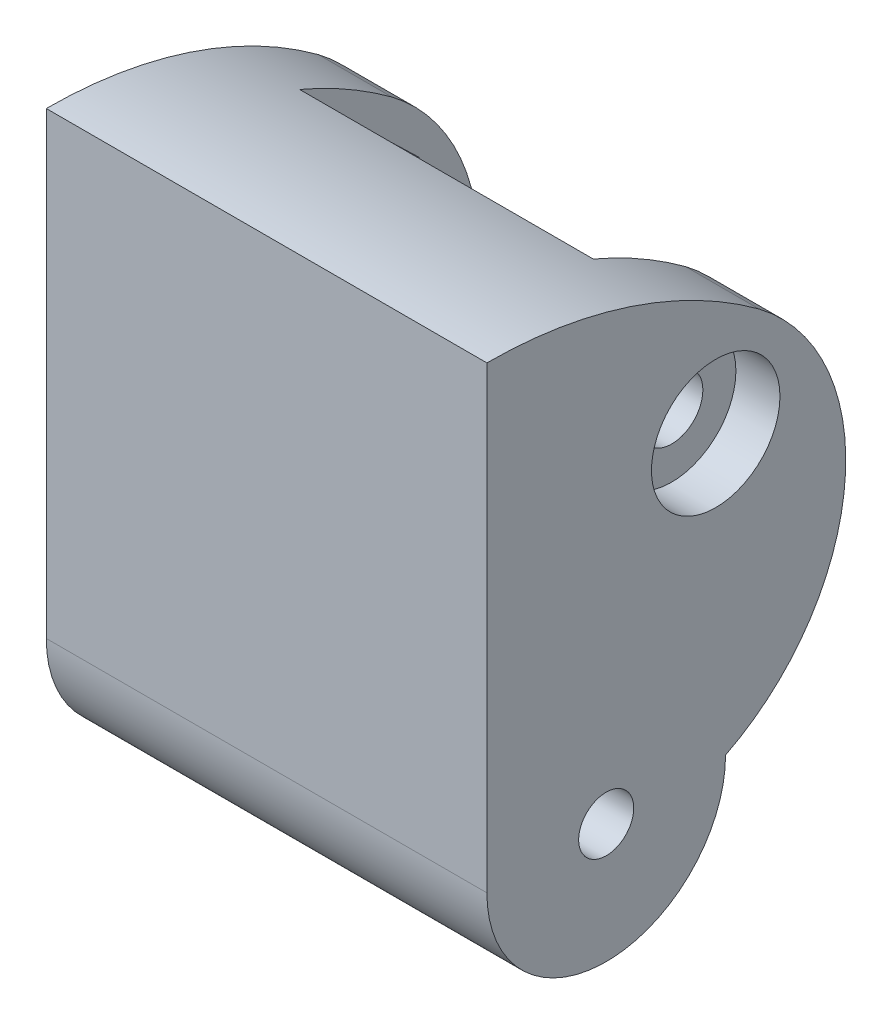
ISO-10303-21;
HEADER;
FILE_DESCRIPTION(('STEP AP214'),'2;1');
FILE_NAME('part.step','',(''),(''),'','','');
FILE_SCHEMA(('AUTOMOTIVE_DESIGN { 1 0 10303 214 1 1 1 1 }'));
ENDSEC;
DATA;
#1=APPLICATION_CONTEXT('core data for automotive mechanical design processes');
#2=APPLICATION_PROTOCOL_DEFINITION('international standard','automotive_design',2000,#1);
#3=PRODUCT_CONTEXT('',#1,'mechanical');
#4=PRODUCT('Part','Part','',(#3));
#5=PRODUCT_RELATED_PRODUCT_CATEGORY('part','',(#4));
#6=PRODUCT_DEFINITION_FORMATION('','',#4);
#7=PRODUCT_DEFINITION_CONTEXT('part definition',#1,'design');
#8=PRODUCT_DEFINITION('design','',#6,#7);
#9=PRODUCT_DEFINITION_SHAPE('','',#8);
#10=(LENGTH_UNIT() NAMED_UNIT(*) SI_UNIT(.MILLI.,.METRE.));
#11=(NAMED_UNIT(*) PLANE_ANGLE_UNIT() SI_UNIT($,.RADIAN.));
#12=(NAMED_UNIT(*) SI_UNIT($,.STERADIAN.) SOLID_ANGLE_UNIT());
#13=UNCERTAINTY_MEASURE_WITH_UNIT(LENGTH_MEASURE(1.E-05),#10,'distance_accuracy_value','');
#14=(GEOMETRIC_REPRESENTATION_CONTEXT(3) GLOBAL_UNCERTAINTY_ASSIGNED_CONTEXT((#13)) GLOBAL_UNIT_ASSIGNED_CONTEXT((#10,
#11,#12)) REPRESENTATION_CONTEXT('',''));
#15=CARTESIAN_POINT('',(0.,0.,0.));
#16=DIRECTION('',(0.,0.,1.));
#17=DIRECTION('',(1.,0.,0.));
#18=AXIS2_PLACEMENT_3D('',#15,#16,#17);
#19=CARTESIAN_POINT('',(24.,6.90912750795795,5.26739573253868));
#20=DIRECTION('',(-1.,0.,0.));
#21=DIRECTION('',(0.,0.,1.));
#22=AXIS2_PLACEMENT_3D('',#19,#20,#21);
#23=CYLINDRICAL_SURFACE('',#22,11.9077785335107);
#24=CARTESIAN_POINT('',(20.,6.90912750795795,5.26739573253868));
#25=DIRECTION('',(-1.,0.,0.));
#26=DIRECTION('',(0.,0.,1.));
#27=AXIS2_PLACEMENT_3D('',#24,#25,#26);
#28=CIRCLE('',#27,11.9077785335107);
#29=CARTESIAN_POINT('',(20.,16.4064601891265,-1.91563019991807));
#30=VERTEX_POINT('',#29);
#31=CARTESIAN_POINT('',(20.,2.27551020408163,-5.70186952473154));
#32=VERTEX_POINT('',#31);
#33=EDGE_CURVE('E210',#30,#32,#28,.T.);
#34=ORIENTED_EDGE('',*,*,#33,.F.);
#35=DIRECTION('',(-1.,0.,0.));
#36=VECTOR('',#35,1.);
#37=CARTESIAN_POINT('',(24.,16.4064601891265,-1.91563019991807));
#38=LINE('',#37,#36);
#39=CARTESIAN_POINT('',(24.,16.4064601891265,-1.91563019991807));
#40=VERTEX_POINT('',#39);
#41=EDGE_CURVE('E254',#40,#30,#38,.T.);
#42=ORIENTED_EDGE('',*,*,#41,.F.);
#43=CARTESIAN_POINT('',(24.,6.90912750795795,5.26739573253868));
#44=DIRECTION('',(1.,0.,0.));
#45=DIRECTION('',(0.,0.,-1.));
#46=AXIS2_PLACEMENT_3D('',#43,#44,#45);
#47=CIRCLE('',#46,11.9077785335107);
#48=CARTESIAN_POINT('',(24.,-3.72448979591837,-0.0918367346938826));
#49=VERTEX_POINT('',#48);
#50=EDGE_CURVE('E229',#49,#40,#47,.T.);
#51=ORIENTED_EDGE('',*,*,#50,.F.);
#52=DIRECTION('',(-1.,0.,0.));
#53=VECTOR('',#52,1.);
#54=CARTESIAN_POINT('',(24.,-3.72448979591837,-0.0918367346938826));
#55=LINE('',#54,#53);
#56=CARTESIAN_POINT('',(0.,-3.72448979591837,-0.0918367346938826));
#57=VERTEX_POINT('',#56);
#58=EDGE_CURVE('E257',#49,#57,#55,.T.);
#59=ORIENTED_EDGE('',*,*,#58,.T.);
#60=CARTESIAN_POINT('',(0.,6.90912750795795,5.26739573253868));
#61=DIRECTION('',(1.,0.,0.));
#62=DIRECTION('',(0.,0.,-1.));
#63=AXIS2_PLACEMENT_3D('',#60,#61,#62);
#64=CIRCLE('',#63,11.9077785335107);
#65=CARTESIAN_POINT('',(0.,16.4064601891265,-1.91563019991807));
#66=VERTEX_POINT('',#65);
#67=EDGE_CURVE('E242',#57,#66,#64,.T.);
#68=ORIENTED_EDGE('',*,*,#67,.T.);
#69=CARTESIAN_POINT('',(4.,16.4064601891265,-1.91563019991807));
#70=VERTEX_POINT('',#69);
#71=EDGE_CURVE('E253',#70,#66,#38,.T.);
#72=ORIENTED_EDGE('',*,*,#71,.F.);
#73=CARTESIAN_POINT('',(4.,6.90912750795795,5.26739573253868));
#74=DIRECTION('',(1.,0.,0.));
#75=DIRECTION('',(0.,1.,0.));
#76=AXIS2_PLACEMENT_3D('',#73,#74,#75);
#77=CIRCLE('',#76,11.9077785335107);
#78=CARTESIAN_POINT('',(4.,2.27551020408163,-5.70186952473154));
#79=VERTEX_POINT('',#78);
#80=EDGE_CURVE('E204',#79,#70,#77,.T.);
#81=ORIENTED_EDGE('',*,*,#80,.F.);
#82=DIRECTION('',(-1.,0.,0.));
#83=VECTOR('',#82,1.);
#84=CARTESIAN_POINT('',(24.,2.27551020408163,-5.70186952473154));
#85=LINE('',#84,#83);
#86=EDGE_CURVE('E265',#32,#79,#85,.T.);
#87=ORIENTED_EDGE('',*,*,#86,.F.);
#88=EDGE_LOOP('',(#34,#42,#51,#59,#68,#72,#81,#87));
#89=FACE_BOUND('',#88,.T.);
#90=ADVANCED_FACE('F35',(#89),#23,.T.);
#91=CARTESIAN_POINT('',(24.,-3.72448979591837,12.9081632653061));
#92=DIRECTION('',(-1.,0.,0.));
#93=DIRECTION('',(0.,0.,1.));
#94=AXIS2_PLACEMENT_3D('',#91,#92,#93);
#95=CYLINDRICAL_SURFACE('',#94,25.);
#96=ORIENTED_EDGE('',*,*,#41,.T.);
#97=CARTESIAN_POINT('',(20.,-3.72448979591837,12.9081632653061));
#98=DIRECTION('',(-1.,0.,0.));
#99=DIRECTION('',(0.,0.,1.));
#100=AXIS2_PLACEMENT_3D('',#97,#98,#99);
#101=CIRCLE('',#100,25.);
#102=CARTESIAN_POINT('',(20.,19.2755102040816,3.1102042941734));
#103=VERTEX_POINT('',#102);
#104=EDGE_CURVE('E207',#30,#103,#101,.F.);
#105=ORIENTED_EDGE('',*,*,#104,.T.);
#106=DIRECTION('',(-1.,0.,0.));
#107=VECTOR('',#106,1.);
#108=CARTESIAN_POINT('',(24.,19.2755102040816,3.1102042941734));
#109=LINE('',#108,#107);
#110=CARTESIAN_POINT('',(4.,19.2755102040816,3.1102042941734));
#111=VERTEX_POINT('',#110);
#112=EDGE_CURVE('E260',#103,#111,#109,.T.);
#113=ORIENTED_EDGE('',*,*,#112,.T.);
#114=CARTESIAN_POINT('',(4.,-3.72448979591837,12.9081632653061));
#115=DIRECTION('',(1.,0.,0.));
#116=DIRECTION('',(0.,1.,0.));
#117=AXIS2_PLACEMENT_3D('',#114,#115,#116);
#118=CIRCLE('',#117,25.);
#119=EDGE_CURVE('E201',#111,#70,#118,.F.);
#120=ORIENTED_EDGE('',*,*,#119,.T.);
#121=ORIENTED_EDGE('',*,*,#71,.T.);
#122=CARTESIAN_POINT('',(0.,-3.72448979591837,12.9081632653061));
#123=DIRECTION('',(1.,0.,0.));
#124=DIRECTION('',(0.,0.,-1.));
#125=AXIS2_PLACEMENT_3D('',#122,#123,#124);
#126=CIRCLE('',#125,25.);
#127=CARTESIAN_POINT('',(0.,21.2755102040816,12.9081632653061));
#128=VERTEX_POINT('',#127);
#129=EDGE_CURVE('E245',#128,#66,#126,.F.);
#130=ORIENTED_EDGE('',*,*,#129,.F.);
#131=DIRECTION('',(-1.,0.,0.));
#132=VECTOR('',#131,1.);
#133=CARTESIAN_POINT('',(24.,21.2755102040816,12.9081632653061));
#134=LINE('',#133,#132);
#135=CARTESIAN_POINT('',(24.,21.2755102040816,12.9081632653061));
#136=VERTEX_POINT('',#135);
#137=EDGE_CURVE('E251',#136,#128,#134,.T.);
#138=ORIENTED_EDGE('',*,*,#137,.F.);
#139=CARTESIAN_POINT('',(24.,-3.72448979591837,12.9081632653061));
#140=DIRECTION('',(1.,0.,0.));
#141=DIRECTION('',(0.,0.,-1.));
#142=AXIS2_PLACEMENT_3D('',#139,#140,#141);
#143=CIRCLE('',#142,25.);
#144=EDGE_CURVE('E231',#136,#40,#143,.F.);
#145=ORIENTED_EDGE('',*,*,#144,.T.);
#146=EDGE_LOOP('',(#96,#105,#113,#120,#121,#130,#138,#145));
#147=FACE_BOUND('',#146,.T.);
#148=ADVANCED_FACE('F299',(#147),#95,.T.);
#149=CARTESIAN_POINT('',(24.,11.7152741478892,0.443639472137658));
#150=DIRECTION('',(1.,0.,0.));
#151=DIRECTION('',(0.,0.,-1.));
#152=AXIS2_PLACEMENT_3D('',#149,#150,#151);
#153=CYLINDRICAL_SURFACE('',#152,1.7);
#154=CARTESIAN_POINT('',(21.6,11.7152741478892,0.443639472137658));
#155=DIRECTION('',(1.,0.,0.));
#156=DIRECTION('',(0.,0.,-1.));
#157=AXIS2_PLACEMENT_3D('',#154,#155,#156);
#158=CIRCLE('',#157,1.7);
#159=CARTESIAN_POINT('',(21.6,11.7152741478892,-1.25636052786234));
#160=VERTEX_POINT('',#159);
#161=EDGE_CURVE('E218',#160,#160,#158,.T.);
#162=ORIENTED_EDGE('',*,*,#161,.T.);
#163=EDGE_LOOP('',(#162));
#164=FACE_BOUND('',#163,.T.);
#165=CARTESIAN_POINT('',(20.,11.7152741478892,0.443639472137658));
#166=DIRECTION('',(-1.,0.,0.));
#167=DIRECTION('',(0.,0.,1.));
#168=AXIS2_PLACEMENT_3D('',#165,#166,#167);
#169=CIRCLE('',#168,1.7);
#170=CARTESIAN_POINT('',(20.,11.7152741478892,2.14363947213765));
#171=VERTEX_POINT('',#170);
#172=EDGE_CURVE('E206',#171,#171,#169,.F.);
#173=ORIENTED_EDGE('',*,*,#172,.F.);
#174=EDGE_LOOP('',(#173));
#175=FACE_BOUND('',#174,.T.);
#176=ADVANCED_FACE('F305',(#164,#175),#153,.F.);
#177=CARTESIAN_POINT('',(24.,-3.72448979591837,6.40816326530612));
#178=DIRECTION('',(-1.,0.,0.));
#179=DIRECTION('',(0.,0.,1.));
#180=AXIS2_PLACEMENT_3D('',#177,#178,#179);
#181=CYLINDRICAL_SURFACE('',#180,6.5);
#182=CARTESIAN_POINT('',(0.,-3.72448979591837,6.40816326530612));
#183=DIRECTION('',(1.,0.,0.));
#184=DIRECTION('',(0.,0.,-1.));
#185=AXIS2_PLACEMENT_3D('',#182,#183,#184);
#186=CIRCLE('',#185,6.5);
#187=CARTESIAN_POINT('',(0.,-3.72448979591837,12.9081632653061));
#188=VERTEX_POINT('',#187);
#189=EDGE_CURVE('E239',#188,#57,#186,.T.);
#190=ORIENTED_EDGE('',*,*,#189,.T.);
#191=ORIENTED_EDGE('',*,*,#58,.F.);
#192=CARTESIAN_POINT('',(24.,-3.72448979591837,6.40816326530612));
#193=DIRECTION('',(1.,0.,0.));
#194=DIRECTION('',(0.,0.,-1.));
#195=AXIS2_PLACEMENT_3D('',#192,#193,#194);
#196=CIRCLE('',#195,6.5);
#197=CARTESIAN_POINT('',(24.,-3.72448979591837,12.9081632653061));
#198=VERTEX_POINT('',#197);
#199=EDGE_CURVE('E225',#198,#49,#196,.T.);
#200=ORIENTED_EDGE('',*,*,#199,.F.);
#201=DIRECTION('',(-1.,0.,0.));
#202=VECTOR('',#201,1.);
#203=CARTESIAN_POINT('',(24.,-3.72448979591837,12.9081632653061));
#204=LINE('',#203,#202);
#205=EDGE_CURVE('E236',#198,#188,#204,.T.);
#206=ORIENTED_EDGE('',*,*,#205,.T.);
#207=EDGE_LOOP('',(#190,#191,#200,#206));
#208=FACE_BOUND('',#207,.T.);
#209=ADVANCED_FACE('F310',(#208),#181,.T.);
#210=CARTESIAN_POINT('',(24.,-3.72448979591837,6.40816326530612));
#211=DIRECTION('',(-1.,0.,0.));
#212=DIRECTION('',(0.,0.,1.));
#213=AXIS2_PLACEMENT_3D('',#210,#211,#212);
#214=CYLINDRICAL_SURFACE('',#213,1.5);
#215=CARTESIAN_POINT('',(24.,-3.72448979591837,6.40816326530612));
#216=DIRECTION('',(1.,0.,0.));
#217=DIRECTION('',(0.,0.,-1.));
#218=AXIS2_PLACEMENT_3D('',#215,#216,#217);
#219=CIRCLE('',#218,1.5);
#220=CARTESIAN_POINT('',(24.,-3.72448979591837,4.90816326530612));
#221=VERTEX_POINT('',#220);
#222=EDGE_CURVE('E222',#221,#221,#219,.T.);
#223=ORIENTED_EDGE('',*,*,#222,.T.);
#224=EDGE_LOOP('',(#223));
#225=FACE_BOUND('',#224,.T.);
#226=CARTESIAN_POINT('',(0.,-3.72448979591837,6.40816326530612));
#227=DIRECTION('',(1.,0.,0.));
#228=DIRECTION('',(0.,0.,-1.));
#229=AXIS2_PLACEMENT_3D('',#226,#227,#228);
#230=CIRCLE('',#229,1.5);
#231=CARTESIAN_POINT('',(0.,-3.72448979591837,4.90816326530612));
#232=VERTEX_POINT('',#231);
#233=EDGE_CURVE('E221',#232,#232,#230,.T.);
#234=ORIENTED_EDGE('',*,*,#233,.F.);
#235=EDGE_LOOP('',(#234));
#236=FACE_BOUND('',#235,.T.);
#237=ADVANCED_FACE('F37',(#225,#236),#214,.F.);
#238=CARTESIAN_POINT('',(24.,0.,12.9081632653061));
#239=DIRECTION('',(0.,0.,-1.));
#240=DIRECTION('',(-1.,0.,0.));
#241=AXIS2_PLACEMENT_3D('',#238,#239,#240);
#242=PLANE('',#241);
#243=DIRECTION('',(0.,-1.,0.));
#244=VECTOR('',#243,1.);
#245=CARTESIAN_POINT('',(0.,0.,12.9081632653061));
#246=LINE('',#245,#244);
#247=EDGE_CURVE('E226',#128,#188,#246,.T.);
#248=ORIENTED_EDGE('',*,*,#247,.T.);
#249=ORIENTED_EDGE('',*,*,#205,.F.);
#250=DIRECTION('',(0.,-1.,0.));
#251=VECTOR('',#250,1.);
#252=CARTESIAN_POINT('',(24.,0.,12.9081632653061));
#253=LINE('',#252,#251);
#254=EDGE_CURVE('E234',#136,#198,#253,.T.);
#255=ORIENTED_EDGE('',*,*,#254,.F.);
#256=ORIENTED_EDGE('',*,*,#137,.T.);
#257=EDGE_LOOP('',(#248,#249,#255,#256));
#258=FACE_BOUND('',#257,.T.);
#259=ADVANCED_FACE('F317',(#258),#242,.F.);
#260=CARTESIAN_POINT('',(24.,0.,0.));
#261=DIRECTION('',(1.,0.,0.));
#262=DIRECTION('',(0.,0.,-1.));
#263=AXIS2_PLACEMENT_3D('',#260,#261,#262);
#264=PLANE('',#263);
#265=CARTESIAN_POINT('',(24.,11.7152741478892,0.443639472137658));
#266=DIRECTION('',(1.,0.,0.));
#267=DIRECTION('',(0.,0.,-1.));
#268=AXIS2_PLACEMENT_3D('',#265,#266,#267);
#269=CIRCLE('',#268,3.5);
#270=CARTESIAN_POINT('',(24.,11.7152741478892,-3.05636052786234));
#271=VERTEX_POINT('',#270);
#272=EDGE_CURVE('E212',#271,#271,#269,.T.);
#273=ORIENTED_EDGE('',*,*,#272,.F.);
#274=EDGE_LOOP('',(#273));
#275=FACE_BOUND('',#274,.T.);
#276=ORIENTED_EDGE('',*,*,#222,.F.);
#277=EDGE_LOOP('',(#276));
#278=FACE_BOUND('',#277,.T.);
#279=ORIENTED_EDGE('',*,*,#199,.T.);
#280=ORIENTED_EDGE('',*,*,#50,.T.);
#281=ORIENTED_EDGE('',*,*,#144,.F.);
#282=ORIENTED_EDGE('',*,*,#254,.T.);
#283=EDGE_LOOP('',(#279,#280,#281,#282));
#284=FACE_BOUND('',#283,.T.);
#285=ADVANCED_FACE('F332',(#275,#278,#284),#264,.T.);
#286=CARTESIAN_POINT('',(0.,0.,0.));
#287=DIRECTION('',(1.,0.,0.));
#288=DIRECTION('',(0.,0.,-1.));
#289=AXIS2_PLACEMENT_3D('',#286,#287,#288);
#290=PLANE('',#289);
#291=DIRECTION('',(0.,0.694815164914117,0.719188352662478));
#292=VECTOR('',#291,1.);
#293=CARTESIAN_POINT('',(0.,7.83430228401462,1.4121731018139));
#294=LINE('',#293,#292);
#295=CARTESIAN_POINT('',(0.,7.83430228401462,1.4121731018139));
#296=VERTEX_POINT('',#295);
#297=CARTESIAN_POINT('',(0.,10.6135629436711,4.28892651246382));
#298=VERTEX_POINT('',#297);
#299=EDGE_CURVE('E153',#296,#298,#294,.T.);
#300=ORIENTED_EDGE('',*,*,#299,.F.);
#301=DIRECTION('',(0.,-0.275427801054529,0.961321760081538));
#302=VECTOR('',#301,1.);
#303=CARTESIAN_POINT('',(0.,8.93601348823274,-2.43311393851226));
#304=LINE('',#303,#302);
#305=CARTESIAN_POINT('',(0.,8.93601348823274,-2.43311393851226));
#306=VERTEX_POINT('',#305);
#307=EDGE_CURVE('E50',#306,#296,#304,.T.);
#308=ORIENTED_EDGE('',*,*,#307,.F.);
#309=DIRECTION('',(0.,-0.970242965968646,0.24213340741906));
#310=VECTOR('',#309,1.);
#311=CARTESIAN_POINT('',(0.,12.8169853521073,-3.4016475681885));
#312=LINE('',#311,#310);
#313=CARTESIAN_POINT('',(0.,12.8169853521073,-3.4016475681885));
#314=VERTEX_POINT('',#313);
#315=EDGE_CURVE('E169',#314,#306,#312,.T.);
#316=ORIENTED_EDGE('',*,*,#315,.F.);
#317=DIRECTION('',(0.,-0.694815164914117,-0.719188352662478));
#318=VECTOR('',#317,1.);
#319=CARTESIAN_POINT('',(0.,15.5962460117638,-0.524894157538583));
#320=LINE('',#319,#318);
#321=CARTESIAN_POINT('',(0.,15.5962460117638,-0.524894157538583));
#322=VERTEX_POINT('',#321);
#323=EDGE_CURVE('E163',#322,#314,#320,.T.);
#324=ORIENTED_EDGE('',*,*,#323,.F.);
#325=DIRECTION('',(0.,0.275427801054529,-0.961321760081538));
#326=VECTOR('',#325,1.);
#327=CARTESIAN_POINT('',(0.,14.4945348075457,3.32039288278758));
#328=LINE('',#327,#326);
#329=CARTESIAN_POINT('',(0.,14.4945348075457,3.32039288278758));
#330=VERTEX_POINT('',#329);
#331=EDGE_CURVE('E161',#330,#322,#328,.T.);
#332=ORIENTED_EDGE('',*,*,#331,.F.);
#333=DIRECTION('',(0.,0.970242965968646,-0.24213340741906));
#334=VECTOR('',#333,1.);
#335=CARTESIAN_POINT('',(0.,10.6135629436711,4.28892651246382));
#336=LINE('',#335,#334);
#337=EDGE_CURVE('E144',#298,#330,#336,.T.);
#338=ORIENTED_EDGE('',*,*,#337,.F.);
#339=EDGE_LOOP('',(#300,#308,#316,#324,#332,#338));
#340=FACE_BOUND('',#339,.T.);
#341=ORIENTED_EDGE('',*,*,#233,.T.);
#342=EDGE_LOOP('',(#341));
#343=FACE_BOUND('',#342,.T.);
#344=ORIENTED_EDGE('',*,*,#189,.F.);
#345=ORIENTED_EDGE('',*,*,#247,.F.);
#346=ORIENTED_EDGE('',*,*,#129,.T.);
#347=ORIENTED_EDGE('',*,*,#67,.F.);
#348=EDGE_LOOP('',(#344,#345,#346,#347));
#349=FACE_BOUND('',#348,.T.);
#350=ADVANCED_FACE('F157',(#340,#343,#349),#290,.F.);
#351=CARTESIAN_POINT('',(21.6,13.4152741478892,0.443639472137658));
#352=DIRECTION('',(-1.,0.,0.));
#353=DIRECTION('',(0.,0.,1.));
#354=AXIS2_PLACEMENT_3D('',#351,#352,#353);
#355=PLANE('',#354);
#356=ORIENTED_EDGE('',*,*,#161,.F.);
#357=EDGE_LOOP('',(#356));
#358=FACE_BOUND('',#357,.T.);
#359=CARTESIAN_POINT('',(21.6,11.7152741478892,0.443639472137658));
#360=DIRECTION('',(1.,0.,0.));
#361=DIRECTION('',(0.,0.,-1.));
#362=AXIS2_PLACEMENT_3D('',#359,#360,#361);
#363=CIRCLE('',#362,3.5);
#364=CARTESIAN_POINT('',(21.6,11.7152741478892,-3.05636052786234));
#365=VERTEX_POINT('',#364);
#366=EDGE_CURVE('E215',#365,#365,#363,.T.);
#367=ORIENTED_EDGE('',*,*,#366,.T.);
#368=EDGE_LOOP('',(#367));
#369=FACE_BOUND('',#368,.T.);
#370=ADVANCED_FACE('F369',(#358,#369),#355,.F.);
#371=CARTESIAN_POINT('',(24.,11.7152741478892,0.443639472137658));
#372=DIRECTION('',(1.,0.,0.));
#373=DIRECTION('',(0.,0.,-1.));
#374=AXIS2_PLACEMENT_3D('',#371,#372,#373);
#375=CYLINDRICAL_SURFACE('',#374,3.5);
#376=ORIENTED_EDGE('',*,*,#366,.F.);
#377=EDGE_LOOP('',(#376));
#378=FACE_BOUND('',#377,.T.);
#379=ORIENTED_EDGE('',*,*,#272,.T.);
#380=EDGE_LOOP('',(#379));
#381=FACE_BOUND('',#380,.T.);
#382=ADVANCED_FACE('F366',(#378,#381),#375,.F.);
#383=CARTESIAN_POINT('',(20.,2.27551020408163,9.));
#384=DIRECTION('',(0.,1.,0.));
#385=DIRECTION('',(-1.,0.,0.));
#386=AXIS2_PLACEMENT_3D('',#383,#384,#385);
#387=PLANE('',#386);
#388=ORIENTED_EDGE('',*,*,#86,.T.);
#389=DIRECTION('',(0.,0.,-1.));
#390=VECTOR('',#389,1.);
#391=CARTESIAN_POINT('',(4.,2.27551020408163,9.));
#392=LINE('',#391,#390);
#393=CARTESIAN_POINT('',(4.,2.27551020408163,9.));
#394=VERTEX_POINT('',#393);
#395=EDGE_CURVE('E192',#394,#79,#392,.T.);
#396=ORIENTED_EDGE('',*,*,#395,.F.);
#397=DIRECTION('',(1.,0.,0.));
#398=VECTOR('',#397,1.);
#399=CARTESIAN_POINT('',(20.,2.27551020408163,9.));
#400=LINE('',#399,#398);
#401=CARTESIAN_POINT('',(20.,2.27551020408163,9.));
#402=VERTEX_POINT('',#401);
#403=EDGE_CURVE('E187',#394,#402,#400,.T.);
#404=ORIENTED_EDGE('',*,*,#403,.T.);
#405=DIRECTION('',(0.,0.,-1.));
#406=VECTOR('',#405,1.);
#407=CARTESIAN_POINT('',(20.,2.27551020408163,9.));
#408=LINE('',#407,#406);
#409=EDGE_CURVE('E189',#402,#32,#408,.T.);
#410=ORIENTED_EDGE('',*,*,#409,.T.);
#411=EDGE_LOOP('',(#388,#396,#404,#410));
#412=FACE_BOUND('',#411,.T.);
#413=ADVANCED_FACE('F342',(#412),#387,.T.);
#414=CARTESIAN_POINT('',(20.,19.2755102040816,9.));
#415=DIRECTION('',(-1.,0.,0.));
#416=DIRECTION('',(0.,0.,1.));
#417=AXIS2_PLACEMENT_3D('',#414,#415,#416);
#418=PLANE('',#417);
#419=ORIENTED_EDGE('',*,*,#172,.T.);
#420=EDGE_LOOP('',(#419));
#421=FACE_BOUND('',#420,.T.);
#422=ORIENTED_EDGE('',*,*,#33,.T.);
#423=ORIENTED_EDGE('',*,*,#409,.F.);
#424=DIRECTION('',(0.,1.,0.));
#425=VECTOR('',#424,1.);
#426=CARTESIAN_POINT('',(20.,19.2755102040816,9.));
#427=LINE('',#426,#425);
#428=CARTESIAN_POINT('',(20.,19.2755102040816,9.));
#429=VERTEX_POINT('',#428);
#430=EDGE_CURVE('E174',#402,#429,#427,.T.);
#431=ORIENTED_EDGE('',*,*,#430,.T.);
#432=DIRECTION('',(0.,0.,-1.));
#433=VECTOR('',#432,1.);
#434=CARTESIAN_POINT('',(20.,19.2755102040816,9.));
#435=LINE('',#434,#433);
#436=EDGE_CURVE('E198',#429,#103,#435,.T.);
#437=ORIENTED_EDGE('',*,*,#436,.T.);
#438=ORIENTED_EDGE('',*,*,#104,.F.);
#439=EDGE_LOOP('',(#422,#423,#431,#437,#438));
#440=FACE_BOUND('',#439,.T.);
#441=ADVANCED_FACE('F349',(#421,#440),#418,.T.);
#442=CARTESIAN_POINT('',(4.,19.2755102040816,9.));
#443=DIRECTION('',(1.,0.,0.));
#444=DIRECTION('',(0.,1.,0.));
#445=AXIS2_PLACEMENT_3D('',#442,#443,#444);
#446=PLANE('',#445);
#447=DIRECTION('',(0.,0.275427801054529,-0.961321760081538));
#448=VECTOR('',#447,1.);
#449=CARTESIAN_POINT('',(4.,6.69317285267764,5.39504102296662));
#450=LINE('',#449,#448);
#451=CARTESIAN_POINT('',(4.,7.83430228401462,1.4121731018139));
#452=VERTEX_POINT('',#451);
#453=CARTESIAN_POINT('',(4.,8.93601348823274,-2.43311393851226));
#454=VERTEX_POINT('',#453);
#455=EDGE_CURVE('E11',#452,#454,#450,.T.);
#456=ORIENTED_EDGE('',*,*,#455,.F.);
#457=DIRECTION('',(0.,-0.694815164914117,-0.719188352662478));
#458=VECTOR('',#457,1.);
#459=CARTESIAN_POINT('',(4.,17.1494123126957,11.0540447457999));
#460=LINE('',#459,#458);
#461=CARTESIAN_POINT('',(4.,10.6135629436711,4.28892651246382));
#462=VERTEX_POINT('',#461);
#463=EDGE_CURVE('E267',#462,#452,#460,.T.);
#464=ORIENTED_EDGE('',*,*,#463,.F.);
#465=DIRECTION('',(0.,-0.970242965968646,0.24213340741906));
#466=VECTOR('',#465,1.);
#467=CARTESIAN_POINT('',(4.,17.6609082944902,2.53019410944236));
#468=LINE('',#467,#466);
#469=CARTESIAN_POINT('',(4.,14.4945348075457,3.32039288278758));
#470=VERTEX_POINT('',#469);
#471=EDGE_CURVE('E147',#470,#462,#468,.T.);
#472=ORIENTED_EDGE('',*,*,#471,.F.);
#473=DIRECTION('',(0.,-0.275427801054529,0.961321760081538));
#474=VECTOR('',#473,1.);
#475=CARTESIAN_POINT('',(4.,13.3534053762087,7.30326080394029));
#476=LINE('',#475,#474);
#477=CARTESIAN_POINT('',(4.,15.5962460117638,-0.524894157538583));
#478=VERTEX_POINT('',#477);
#479=EDGE_CURVE('E270',#478,#470,#476,.T.);
#480=ORIENTED_EDGE('',*,*,#479,.F.);
#481=DIRECTION('',(0.,0.694815164914117,0.719188352662478));
#482=VECTOR('',#481,1.);
#483=CARTESIAN_POINT('',(4.,22.1320953807884,6.24022407579751));
#484=LINE('',#483,#482);
#485=CARTESIAN_POINT('',(4.,12.8169853521073,-3.4016475681885));
#486=VERTEX_POINT('',#485);
#487=EDGE_CURVE('E272',#486,#478,#484,.T.);
#488=ORIENTED_EDGE('',*,*,#487,.F.);
#489=DIRECTION('',(0.,0.970242965968646,-0.24213340741906));
#490=VECTOR('',#489,1.);
#491=CARTESIAN_POINT('',(4.,15.9833588390518,-4.19184634153372));
#492=LINE('',#491,#490);
#493=EDGE_CURVE('E43',#454,#486,#492,.T.);
#494=ORIENTED_EDGE('',*,*,#493,.F.);
#495=EDGE_LOOP('',(#456,#464,#472,#480,#488,#494));
#496=FACE_BOUND('',#495,.T.);
#497=ORIENTED_EDGE('',*,*,#80,.T.);
#498=ORIENTED_EDGE('',*,*,#119,.F.);
#499=DIRECTION('',(0.,0.,-1.));
#500=VECTOR('',#499,1.);
#501=CARTESIAN_POINT('',(4.,19.2755102040816,9.));
#502=LINE('',#501,#500);
#503=CARTESIAN_POINT('',(4.,19.2755102040816,9.));
#504=VERTEX_POINT('',#503);
#505=EDGE_CURVE('E195',#504,#111,#502,.T.);
#506=ORIENTED_EDGE('',*,*,#505,.F.);
#507=DIRECTION('',(0.,-1.,0.));
#508=VECTOR('',#507,1.);
#509=CARTESIAN_POINT('',(4.,19.2755102040816,9.));
#510=LINE('',#509,#508);
#511=EDGE_CURVE('E185',#504,#394,#510,.T.);
#512=ORIENTED_EDGE('',*,*,#511,.T.);
#513=ORIENTED_EDGE('',*,*,#395,.T.);
#514=EDGE_LOOP('',(#497,#498,#506,#512,#513));
#515=FACE_BOUND('',#514,.T.);
#516=ADVANCED_FACE('F286',(#496,#515),#446,.T.);
#517=CARTESIAN_POINT('',(20.,19.2755102040816,9.));
#518=DIRECTION('',(0.,-1.,0.));
#519=DIRECTION('',(0.,0.,-1.));
#520=AXIS2_PLACEMENT_3D('',#517,#518,#519);
#521=PLANE('',#520);
#522=ORIENTED_EDGE('',*,*,#436,.F.);
#523=DIRECTION('',(-1.,0.,0.));
#524=VECTOR('',#523,1.);
#525=CARTESIAN_POINT('',(20.,19.2755102040816,9.));
#526=LINE('',#525,#524);
#527=EDGE_CURVE('E183',#429,#504,#526,.T.);
#528=ORIENTED_EDGE('',*,*,#527,.T.);
#529=ORIENTED_EDGE('',*,*,#505,.T.);
#530=ORIENTED_EDGE('',*,*,#112,.F.);
#531=EDGE_LOOP('',(#522,#528,#529,#530));
#532=FACE_BOUND('',#531,.T.);
#533=ADVANCED_FACE('F351',(#532),#521,.T.);
#534=CARTESIAN_POINT('',(0.,0.,9.));
#535=DIRECTION('',(0.,0.,-1.));
#536=DIRECTION('',(-1.,0.,0.));
#537=AXIS2_PLACEMENT_3D('',#534,#535,#536);
#538=PLANE('',#537);
#539=ORIENTED_EDGE('',*,*,#430,.F.);
#540=ORIENTED_EDGE('',*,*,#403,.F.);
#541=ORIENTED_EDGE('',*,*,#511,.F.);
#542=ORIENTED_EDGE('',*,*,#527,.F.);
#543=EDGE_LOOP('',(#539,#540,#541,#542));
#544=FACE_BOUND('',#543,.T.);
#545=ADVANCED_FACE('F346',(#544),#538,.T.);
#546=CARTESIAN_POINT('',(7.99999999999999,8.93601348823274,-2.43311393851226));
#547=DIRECTION('',(0.,-0.961321760081538,-0.275427801054529));
#548=DIRECTION('',(0.,0.275427801054529,-0.961321760081538));
#549=AXIS2_PLACEMENT_3D('',#546,#547,#548);
#550=PLANE('',#549);
#551=ORIENTED_EDGE('',*,*,#455,.T.);
#552=DIRECTION('',(-1.,0.,0.));
#553=VECTOR('',#552,1.);
#554=CARTESIAN_POINT('',(7.99999999999999,8.93601348823274,-2.43311393851226));
#555=LINE('',#554,#553);
#556=EDGE_CURVE('E172',#454,#306,#555,.T.);
#557=ORIENTED_EDGE('',*,*,#556,.T.);
#558=ORIENTED_EDGE('',*,*,#307,.T.);
#559=DIRECTION('',(-1.,0.,0.));
#560=VECTOR('',#559,1.);
#561=CARTESIAN_POINT('',(7.99999999999999,7.83430228401462,1.4121731018139));
#562=LINE('',#561,#560);
#563=EDGE_CURVE('E150',#452,#296,#562,.T.);
#564=ORIENTED_EDGE('',*,*,#563,.F.);
#565=EDGE_LOOP('',(#551,#557,#558,#564));
#566=FACE_BOUND('',#565,.T.);
#567=ADVANCED_FACE('F358',(#566),#550,.F.);
#568=CARTESIAN_POINT('',(7.99999999999999,12.8169853521073,-3.4016475681885));
#569=DIRECTION('',(0.,-0.24213340741906,-0.970242965968646));
#570=DIRECTION('',(0.,0.970242965968646,-0.24213340741906));
#571=AXIS2_PLACEMENT_3D('',#568,#569,#570);
#572=PLANE('',#571);
#573=ORIENTED_EDGE('',*,*,#493,.T.);
#574=DIRECTION('',(-1.,0.,0.));
#575=VECTOR('',#574,1.);
#576=CARTESIAN_POINT('',(7.99999999999999,12.8169853521073,-3.4016475681885));
#577=LINE('',#576,#575);
#578=EDGE_CURVE('E175',#486,#314,#577,.T.);
#579=ORIENTED_EDGE('',*,*,#578,.T.);
#580=ORIENTED_EDGE('',*,*,#315,.T.);
#581=ORIENTED_EDGE('',*,*,#556,.F.);
#582=EDGE_LOOP('',(#573,#579,#580,#581));
#583=FACE_BOUND('',#582,.T.);
#584=ADVANCED_FACE('F277',(#583),#572,.F.);
#585=CARTESIAN_POINT('',(7.99999999999999,15.5962460117638,-0.524894157538583));
#586=DIRECTION('',(0.,0.719188352662478,-0.694815164914117));
#587=DIRECTION('',(0.,0.694815164914117,0.719188352662478));
#588=AXIS2_PLACEMENT_3D('',#585,#586,#587);
#589=PLANE('',#588);
#590=ORIENTED_EDGE('',*,*,#487,.T.);
#591=DIRECTION('',(-1.,0.,0.));
#592=VECTOR('',#591,1.);
#593=CARTESIAN_POINT('',(7.99999999999999,15.5962460117638,-0.524894157538583));
#594=LINE('',#593,#592);
#595=EDGE_CURVE('E177',#478,#322,#594,.T.);
#596=ORIENTED_EDGE('',*,*,#595,.T.);
#597=ORIENTED_EDGE('',*,*,#323,.T.);
#598=ORIENTED_EDGE('',*,*,#578,.F.);
#599=EDGE_LOOP('',(#590,#596,#597,#598));
#600=FACE_BOUND('',#599,.T.);
#601=ADVANCED_FACE('F282',(#600),#589,.F.);
#602=CARTESIAN_POINT('',(7.99999999999999,14.4945348075457,3.32039288278758));
#603=DIRECTION('',(0.,0.961321760081538,0.275427801054529));
#604=DIRECTION('',(0.,-0.275427801054529,0.961321760081538));
#605=AXIS2_PLACEMENT_3D('',#602,#603,#604);
#606=PLANE('',#605);
#607=ORIENTED_EDGE('',*,*,#479,.T.);
#608=DIRECTION('',(-1.,0.,0.));
#609=VECTOR('',#608,1.);
#610=CARTESIAN_POINT('',(7.99999999999999,14.4945348075457,3.32039288278758));
#611=LINE('',#610,#609);
#612=EDGE_CURVE('E149',#470,#330,#611,.T.);
#613=ORIENTED_EDGE('',*,*,#612,.T.);
#614=ORIENTED_EDGE('',*,*,#331,.T.);
#615=ORIENTED_EDGE('',*,*,#595,.F.);
#616=EDGE_LOOP('',(#607,#613,#614,#615));
#617=FACE_BOUND('',#616,.T.);
#618=ADVANCED_FACE('F289',(#617),#606,.F.);
#619=CARTESIAN_POINT('',(7.99999999999999,10.6135629436711,4.28892651246382));
#620=DIRECTION('',(0.,0.24213340741906,0.970242965968646));
#621=DIRECTION('',(0.,-0.970242965968646,0.24213340741906));
#622=AXIS2_PLACEMENT_3D('',#619,#620,#621);
#623=PLANE('',#622);
#624=ORIENTED_EDGE('',*,*,#471,.T.);
#625=DIRECTION('',(-1.,0.,0.));
#626=VECTOR('',#625,1.);
#627=CARTESIAN_POINT('',(7.99999999999999,10.6135629436711,4.28892651246382));
#628=LINE('',#627,#626);
#629=EDGE_CURVE('E58',#462,#298,#628,.T.);
#630=ORIENTED_EDGE('',*,*,#629,.T.);
#631=ORIENTED_EDGE('',*,*,#337,.T.);
#632=ORIENTED_EDGE('',*,*,#612,.F.);
#633=EDGE_LOOP('',(#624,#630,#631,#632));
#634=FACE_BOUND('',#633,.T.);
#635=ADVANCED_FACE('F141',(#634),#623,.F.);
#636=CARTESIAN_POINT('',(7.99999999999999,7.83430228401462,1.4121731018139));
#637=DIRECTION('',(0.,-0.719188352662478,0.694815164914117));
#638=DIRECTION('',(0.,-0.694815164914117,-0.719188352662478));
#639=AXIS2_PLACEMENT_3D('',#636,#637,#638);
#640=PLANE('',#639);
#641=ORIENTED_EDGE('',*,*,#463,.T.);
#642=ORIENTED_EDGE('',*,*,#563,.T.);
#643=ORIENTED_EDGE('',*,*,#299,.T.);
#644=ORIENTED_EDGE('',*,*,#629,.F.);
#645=EDGE_LOOP('',(#641,#642,#643,#644));
#646=FACE_BOUND('',#645,.T.);
#647=ADVANCED_FACE('F154',(#646),#640,.F.);
#648=CLOSED_SHELL('',(#90,#148,#176,#209,#237,#259,#285,#350,#370,#382,#413,#441,#516,#533,#545,
#567,#584,#601,#618,#635,#647));
#649=MANIFOLD_SOLID_BREP('B2',#648);
#650=ADVANCED_BREP_SHAPE_REPRESENTATION('',(#18,#649),#14);
#651=SHAPE_DEFINITION_REPRESENTATION(#9,#650);
ENDSEC;
END-ISO-10303-21;
